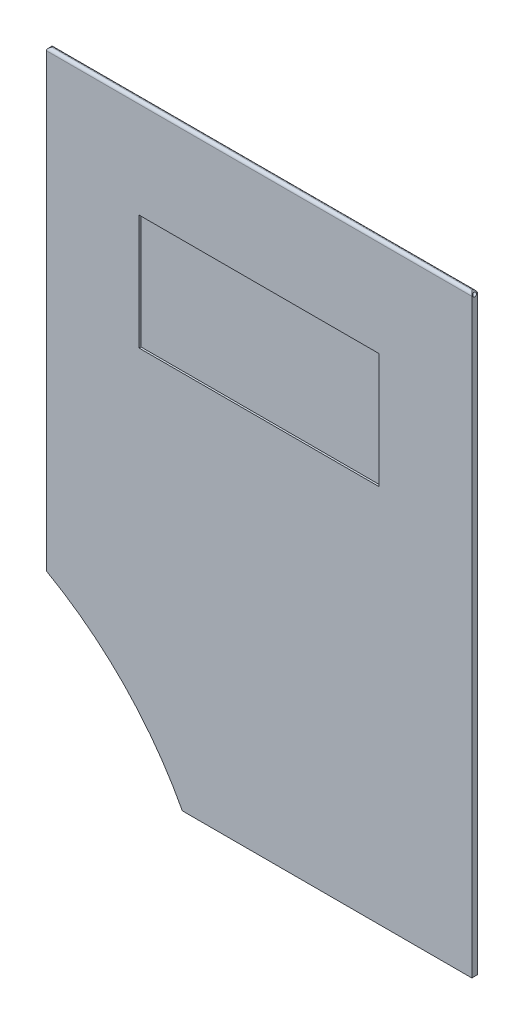
ISO-10303-21;
HEADER;
FILE_DESCRIPTION(('STEP AP214'),'2;1');
FILE_NAME('part.step','',(''),(''),'','','');
FILE_SCHEMA(('AUTOMOTIVE_DESIGN { 1 0 10303 214 1 1 1 1 }'));
ENDSEC;
DATA;
#1=APPLICATION_CONTEXT('core data for automotive mechanical design processes');
#2=APPLICATION_PROTOCOL_DEFINITION('international standard','automotive_design',2000,#1);
#3=PRODUCT_CONTEXT('',#1,'mechanical');
#4=PRODUCT('Part','Part','',(#3));
#5=PRODUCT_RELATED_PRODUCT_CATEGORY('part','',(#4));
#6=PRODUCT_DEFINITION_FORMATION('','',#4);
#7=PRODUCT_DEFINITION_CONTEXT('part definition',#1,'design');
#8=PRODUCT_DEFINITION('design','',#6,#7);
#9=PRODUCT_DEFINITION_SHAPE('','',#8);
#10=(LENGTH_UNIT() NAMED_UNIT(*) SI_UNIT(.MILLI.,.METRE.));
#11=(NAMED_UNIT(*) PLANE_ANGLE_UNIT() SI_UNIT($,.RADIAN.));
#12=(NAMED_UNIT(*) SI_UNIT($,.STERADIAN.) SOLID_ANGLE_UNIT());
#13=UNCERTAINTY_MEASURE_WITH_UNIT(LENGTH_MEASURE(1.E-05),#10,'distance_accuracy_value','');
#14=(GEOMETRIC_REPRESENTATION_CONTEXT(3) GLOBAL_UNCERTAINTY_ASSIGNED_CONTEXT((#13)) GLOBAL_UNIT_ASSIGNED_CONTEXT((#10,
#11,#12)) REPRESENTATION_CONTEXT('',''));
#15=CARTESIAN_POINT('',(0.,0.,0.));
#16=DIRECTION('',(0.,0.,1.));
#17=DIRECTION('',(1.,0.,0.));
#18=AXIS2_PLACEMENT_3D('',#15,#16,#17);
#19=CARTESIAN_POINT('',(-525.375764271538,-753.410434533379,0.));
#20=DIRECTION('',(0.,0.,1.));
#21=DIRECTION('',(1.,0.,0.));
#22=AXIS2_PLACEMENT_3D('',#19,#20,#21);
#23=PLANE('',#22);
#24=DIRECTION('',(0.,1.,0.));
#25=VECTOR('',#24,1.);
#26=CARTESIAN_POINT('',(-653.091871246219,-753.410434533379,0.));
#27=LINE('',#26,#25);
#28=CARTESIAN_POINT('',(-653.091871246219,137.849062600608,0.));
#29=VERTEX_POINT('',#28);
#30=CARTESIAN_POINT('',(-653.091871246219,372.551613641768,0.));
#31=VERTEX_POINT('',#30);
#32=EDGE_CURVE('E230',#29,#31,#27,.T.);
#33=ORIENTED_EDGE('',*,*,#32,.T.);
#34=DIRECTION('',(1.,0.,0.));
#35=VECTOR('',#34,1.);
#36=CARTESIAN_POINT('',(-431.491871246219,372.551613641768,0.));
#37=LINE('',#36,#35);
#38=CARTESIAN_POINT('',(-431.491871246219,372.551613641768,0.));
#39=VERTEX_POINT('',#38);
#40=EDGE_CURVE('E11',#31,#39,#37,.T.);
#41=ORIENTED_EDGE('',*,*,#40,.T.);
#42=DIRECTION('',(0.,1.,0.));
#43=VECTOR('',#42,1.);
#44=CARTESIAN_POINT('',(-431.491871246219,-753.410434533379,0.));
#45=LINE('',#44,#43);
#46=CARTESIAN_POINT('',(-431.491871246219,65.0516136417681,0.));
#47=VERTEX_POINT('',#46);
#48=EDGE_CURVE('E245',#47,#39,#45,.T.);
#49=ORIENTED_EDGE('',*,*,#48,.F.);
#50=DIRECTION('',(-1.,0.,0.));
#51=VECTOR('',#50,1.);
#52=CARTESIAN_POINT('',(-525.375764271538,65.0516136417681,0.));
#53=LINE('',#52,#51);
#54=CARTESIAN_POINT('',(-582.293881309159,65.0516136417681,0.));
#55=VERTEX_POINT('',#54);
#56=EDGE_CURVE('E242',#47,#55,#53,.T.);
#57=ORIENTED_EDGE('',*,*,#56,.T.);
#58=CARTESIAN_POINT('',(-741.491871246218,-18.9483863582319,0.));
#59=DIRECTION('',(0.,0.,1.));
#60=DIRECTION('',(1.,0.,0.));
#61=AXIS2_PLACEMENT_3D('',#58,#59,#60);
#62=CIRCLE('',#61,180.);
#63=EDGE_CURVE('E222',#55,#29,#62,.T.);
#64=ORIENTED_EDGE('',*,*,#63,.T.);
#65=EDGE_LOOP('',(#33,#41,#49,#57,#64));
#66=FACE_BOUND('',#65,.T.);
#67=DIRECTION('',(0.,-1.,0.));
#68=VECTOR('',#67,1.);
#69=CARTESIAN_POINT('',(-604.791871246219,218.801613641768,0.));
#70=LINE('',#69,#68);
#71=CARTESIAN_POINT('',(-604.791871246219,322.551613641768,0.));
#72=VERTEX_POINT('',#71);
#73=CARTESIAN_POINT('',(-604.791871246219,262.551613641768,0.));
#74=VERTEX_POINT('',#73);
#75=EDGE_CURVE('E63',#72,#74,#70,.T.);
#76=ORIENTED_EDGE('',*,*,#75,.T.);
#77=DIRECTION('',(-1.,0.,0.));
#78=VECTOR('',#77,1.);
#79=CARTESIAN_POINT('',(-837.248489039139,262.551613641768,0.));
#80=LINE('',#79,#78);
#81=CARTESIAN_POINT('',(-479.791871246219,262.551613641768,0.));
#82=VERTEX_POINT('',#81);
#83=EDGE_CURVE('E193',#82,#74,#80,.T.);
#84=ORIENTED_EDGE('',*,*,#83,.F.);
#85=DIRECTION('',(0.,-1.,0.));
#86=VECTOR('',#85,1.);
#87=CARTESIAN_POINT('',(-479.791871246219,218.801613641768,0.));
#88=LINE('',#87,#86);
#89=CARTESIAN_POINT('',(-479.791871246219,322.551613641768,0.));
#90=VERTEX_POINT('',#89);
#91=EDGE_CURVE('E206',#90,#82,#88,.T.);
#92=ORIENTED_EDGE('',*,*,#91,.F.);
#93=DIRECTION('',(-1.,0.,0.));
#94=VECTOR('',#93,1.);
#95=CARTESIAN_POINT('',(-837.248489039139,322.551613641768,0.));
#96=LINE('',#95,#94);
#97=EDGE_CURVE('E203',#90,#72,#96,.T.);
#98=ORIENTED_EDGE('',*,*,#97,.T.);
#99=EDGE_LOOP('',(#76,#84,#92,#98));
#100=FACE_BOUND('',#99,.T.);
#101=ADVANCED_FACE('F37',(#66,#100),#23,.F.);
#102=CARTESIAN_POINT('',(-741.491871246218,-18.9483863582319,3.));
#103=DIRECTION('',(0.,0.,-1.));
#104=DIRECTION('',(-1.,0.,0.));
#105=AXIS2_PLACEMENT_3D('',#102,#103,#104);
#106=CYLINDRICAL_SURFACE('',#105,180.);
#107=ORIENTED_EDGE('',*,*,#63,.F.);
#108=DIRECTION('',(0.,0.,-1.));
#109=VECTOR('',#108,1.);
#110=CARTESIAN_POINT('',(-582.293881309159,65.0516136417681,3.));
#111=LINE('',#110,#109);
#112=CARTESIAN_POINT('',(-582.293881309159,65.0516136417681,3.));
#113=VERTEX_POINT('',#112);
#114=EDGE_CURVE('E253',#113,#55,#111,.T.);
#115=ORIENTED_EDGE('',*,*,#114,.F.);
#116=CARTESIAN_POINT('',(-741.491871246218,-18.9483863582319,3.));
#117=DIRECTION('',(0.,0.,1.));
#118=DIRECTION('',(1.,0.,0.));
#119=AXIS2_PLACEMENT_3D('',#116,#117,#118);
#120=CIRCLE('',#119,180.);
#121=CARTESIAN_POINT('',(-653.091871246219,137.849062600608,3.));
#122=VERTEX_POINT('',#121);
#123=EDGE_CURVE('E226',#113,#122,#120,.T.);
#124=ORIENTED_EDGE('',*,*,#123,.T.);
#125=DIRECTION('',(0.,0.,-1.));
#126=VECTOR('',#125,1.);
#127=CARTESIAN_POINT('',(-653.091871246219,137.849062600608,3.));
#128=LINE('',#127,#126);
#129=EDGE_CURVE('E239',#122,#29,#128,.T.);
#130=ORIENTED_EDGE('',*,*,#129,.T.);
#131=EDGE_LOOP('',(#107,#115,#124,#130));
#132=FACE_BOUND('',#131,.T.);
#133=ADVANCED_FACE('F288',(#132),#106,.F.);
#134=CARTESIAN_POINT('',(-525.375764271538,65.0516136417681,3.));
#135=DIRECTION('',(0.,-1.,0.));
#136=DIRECTION('',(1.,0.,0.));
#137=AXIS2_PLACEMENT_3D('',#134,#135,#136);
#138=PLANE('',#137);
#139=ORIENTED_EDGE('',*,*,#56,.F.);
#140=DIRECTION('',(0.,0.,-1.));
#141=VECTOR('',#140,1.);
#142=CARTESIAN_POINT('',(-431.491871246219,65.0516136417681,3.));
#143=LINE('',#142,#141);
#144=CARTESIAN_POINT('',(-431.491871246219,65.0516136417681,3.));
#145=VERTEX_POINT('',#144);
#146=EDGE_CURVE('E251',#145,#47,#143,.T.);
#147=ORIENTED_EDGE('',*,*,#146,.F.);
#148=DIRECTION('',(-1.,0.,0.));
#149=VECTOR('',#148,1.);
#150=CARTESIAN_POINT('',(-525.375764271538,65.0516136417681,3.));
#151=LINE('',#150,#149);
#152=EDGE_CURVE('E229',#145,#113,#151,.T.);
#153=ORIENTED_EDGE('',*,*,#152,.T.);
#154=ORIENTED_EDGE('',*,*,#114,.T.);
#155=EDGE_LOOP('',(#139,#147,#153,#154));
#156=FACE_BOUND('',#155,.T.);
#157=ADVANCED_FACE('F296',(#156),#138,.T.);
#158=CARTESIAN_POINT('',(-431.491871246219,-753.410434533379,3.));
#159=DIRECTION('',(-1.,0.,0.));
#160=DIRECTION('',(0.,0.,1.));
#161=AXIS2_PLACEMENT_3D('',#158,#159,#160);
#162=PLANE('',#161);
#163=ORIENTED_EDGE('',*,*,#48,.T.);
#164=DIRECTION('',(0.,0.,-1.));
#165=VECTOR('',#164,1.);
#166=CARTESIAN_POINT('',(-431.491871246219,372.551613641768,3.));
#167=LINE('',#166,#165);
#168=CARTESIAN_POINT('',(-431.491871246219,372.551613641768,0.5));
#169=VERTEX_POINT('',#168);
#170=EDGE_CURVE('E257',#39,#169,#167,.F.);
#171=ORIENTED_EDGE('',*,*,#170,.T.);
#172=CARTESIAN_POINT('',(-431.491871246219,372.551613641768,1.5));
#173=DIRECTION('',(1.,0.,0.));
#174=DIRECTION('',(0.,0.,-1.));
#175=AXIS2_PLACEMENT_3D('',#172,#173,#174);
#176=CIRCLE('',#175,1.);
#177=CARTESIAN_POINT('',(-431.491871246219,372.551613641768,2.5));
#178=VERTEX_POINT('',#177);
#179=EDGE_CURVE('E223',#178,#169,#176,.T.);
#180=ORIENTED_EDGE('',*,*,#179,.F.);
#181=DIRECTION('',(0.,0.,-1.));
#182=VECTOR('',#181,1.);
#183=CARTESIAN_POINT('',(-431.491871246219,372.551613641768,3.));
#184=LINE('',#183,#182);
#185=CARTESIAN_POINT('',(-431.491871246219,372.551613641768,3.));
#186=VERTEX_POINT('',#185);
#187=EDGE_CURVE('E255',#178,#186,#184,.F.);
#188=ORIENTED_EDGE('',*,*,#187,.T.);
#189=DIRECTION('',(0.,1.,0.));
#190=VECTOR('',#189,1.);
#191=CARTESIAN_POINT('',(-431.491871246219,-753.410434533379,3.));
#192=LINE('',#191,#190);
#193=EDGE_CURVE('E233',#145,#186,#192,.T.);
#194=ORIENTED_EDGE('',*,*,#193,.F.);
#195=ORIENTED_EDGE('',*,*,#146,.T.);
#196=EDGE_LOOP('',(#163,#171,#180,#188,#194,#195));
#197=FACE_BOUND('',#196,.T.);
#198=ADVANCED_FACE('F292',(#197),#162,.F.);
#199=CARTESIAN_POINT('',(-653.091871246219,-753.410434533379,3.));
#200=DIRECTION('',(-1.,0.,0.));
#201=DIRECTION('',(0.,0.,1.));
#202=AXIS2_PLACEMENT_3D('',#199,#200,#201);
#203=PLANE('',#202);
#204=DIRECTION('',(0.,1.,0.));
#205=VECTOR('',#204,1.);
#206=CARTESIAN_POINT('',(-653.091871246219,-753.410434533379,3.));
#207=LINE('',#206,#205);
#208=CARTESIAN_POINT('',(-653.091871246219,372.551613641768,3.));
#209=VERTEX_POINT('',#208);
#210=EDGE_CURVE('E236',#122,#209,#207,.T.);
#211=ORIENTED_EDGE('',*,*,#210,.T.);
#212=DIRECTION('',(0.,0.,-1.));
#213=VECTOR('',#212,1.);
#214=CARTESIAN_POINT('',(-653.091871246219,372.551613641768,3.));
#215=LINE('',#214,#213);
#216=CARTESIAN_POINT('',(-653.091871246219,372.551613641768,2.5));
#217=VERTEX_POINT('',#216);
#218=EDGE_CURVE('E47',#209,#217,#215,.T.);
#219=ORIENTED_EDGE('',*,*,#218,.T.);
#220=CARTESIAN_POINT('',(-653.091871246219,372.551613641768,1.5));
#221=DIRECTION('',(1.,0.,0.));
#222=DIRECTION('',(0.,0.,-1.));
#223=AXIS2_PLACEMENT_3D('',#220,#221,#222);
#224=CIRCLE('',#223,1.);
#225=CARTESIAN_POINT('',(-653.091871246219,372.551613641768,0.5));
#226=VERTEX_POINT('',#225);
#227=EDGE_CURVE('E219',#217,#226,#224,.T.);
#228=ORIENTED_EDGE('',*,*,#227,.T.);
#229=DIRECTION('',(0.,0.,-1.));
#230=VECTOR('',#229,1.);
#231=CARTESIAN_POINT('',(-653.091871246219,372.551613641768,3.));
#232=LINE('',#231,#230);
#233=EDGE_CURVE('E337',#226,#31,#232,.T.);
#234=ORIENTED_EDGE('',*,*,#233,.T.);
#235=ORIENTED_EDGE('',*,*,#32,.F.);
#236=ORIENTED_EDGE('',*,*,#129,.F.);
#237=EDGE_LOOP('',(#211,#219,#228,#234,#235,#236));
#238=FACE_BOUND('',#237,.T.);
#239=ADVANCED_FACE('F284',(#238),#203,.T.);
#240=CARTESIAN_POINT('',(-525.375764271538,-753.410434533379,3.));
#241=DIRECTION('',(0.,0.,1.));
#242=DIRECTION('',(1.,0.,0.));
#243=AXIS2_PLACEMENT_3D('',#240,#241,#242);
#244=PLANE('',#243);
#245=DIRECTION('',(1.,0.,0.));
#246=VECTOR('',#245,1.);
#247=CARTESIAN_POINT('',(-542.291871246219,262.551613641768,3.));
#248=LINE('',#247,#246);
#249=CARTESIAN_POINT('',(-604.791871246219,262.551613641768,3.));
#250=VERTEX_POINT('',#249);
#251=CARTESIAN_POINT('',(-479.791871246219,262.551613641768,3.));
#252=VERTEX_POINT('',#251);
#253=EDGE_CURVE('E55',#250,#252,#248,.T.);
#254=ORIENTED_EDGE('',*,*,#253,.F.);
#255=DIRECTION('',(0.,1.,0.));
#256=VECTOR('',#255,1.);
#257=CARTESIAN_POINT('',(-604.791871246219,-76.1550041511523,3.));
#258=LINE('',#257,#256);
#259=CARTESIAN_POINT('',(-604.791871246219,322.551613641768,3.));
#260=VERTEX_POINT('',#259);
#261=EDGE_CURVE('E172',#250,#260,#258,.T.);
#262=ORIENTED_EDGE('',*,*,#261,.T.);
#263=DIRECTION('',(1.,0.,0.));
#264=VECTOR('',#263,1.);
#265=CARTESIAN_POINT('',(-542.291871246219,322.551613641768,3.));
#266=LINE('',#265,#264);
#267=CARTESIAN_POINT('',(-479.791871246219,322.551613641768,3.));
#268=VERTEX_POINT('',#267);
#269=EDGE_CURVE('E175',#260,#268,#266,.T.);
#270=ORIENTED_EDGE('',*,*,#269,.T.);
#271=DIRECTION('',(0.,1.,0.));
#272=VECTOR('',#271,1.);
#273=CARTESIAN_POINT('',(-479.791871246219,-76.1550041511523,3.));
#274=LINE('',#273,#272);
#275=EDGE_CURVE('E181',#252,#268,#274,.T.);
#276=ORIENTED_EDGE('',*,*,#275,.F.);
#277=EDGE_LOOP('',(#254,#262,#270,#276));
#278=FACE_BOUND('',#277,.T.);
#279=ORIENTED_EDGE('',*,*,#193,.T.);
#280=DIRECTION('',(1.,0.,0.));
#281=VECTOR('',#280,1.);
#282=CARTESIAN_POINT('',(-525.375764271538,372.551613641768,3.));
#283=LINE('',#282,#281);
#284=EDGE_CURVE('E338',#186,#209,#283,.F.);
#285=ORIENTED_EDGE('',*,*,#284,.T.);
#286=ORIENTED_EDGE('',*,*,#210,.F.);
#287=ORIENTED_EDGE('',*,*,#123,.F.);
#288=ORIENTED_EDGE('',*,*,#152,.F.);
#289=EDGE_LOOP('',(#279,#285,#286,#287,#288));
#290=FACE_BOUND('',#289,.T.);
#291=ADVANCED_FACE('F277',(#278,#290),#244,.T.);
#292=CARTESIAN_POINT('',(-653.091871246219,372.551613641768,1.5));
#293=DIRECTION('',(1.,0.,0.));
#294=DIRECTION('',(0.,0.,-1.));
#295=AXIS2_PLACEMENT_3D('',#292,#293,#294);
#296=CYLINDRICAL_SURFACE('',#295,1.);
#297=ORIENTED_EDGE('',*,*,#227,.F.);
#298=CARTESIAN_POINT('',(-653.091871246219,372.551613641768,2.5));
#299=CARTESIAN_POINT('',(-653.091874316553,372.576836632623,2.50000213248189));
#300=CARTESIAN_POINT('',(-653.091234398867,372.602045418243,2.49904499371487));
#301=CARTESIAN_POINT('',(-653.088702447985,372.652242754679,2.49524199874773));
#302=CARTESIAN_POINT('',(-653.086811126063,372.677231422435,2.49239721544421));
#303=CARTESIAN_POINT('',(-653.079344562009,372.751276887335,2.48112709883326));
#304=CARTESIAN_POINT('',(-653.071975712256,372.79976982417,2.46996503151942));
#305=CARTESIAN_POINT('',(-653.053129092996,372.893701241715,2.44095418700607));
#306=CARTESIAN_POINT('',(-653.041658957294,372.939145212124,2.42311782994398));
#307=CARTESIAN_POINT('',(-653.015518727622,373.02627126744,2.38149564691463));
#308=CARTESIAN_POINT('',(-653.000844527774,373.067948427536,2.35770218136302));
#309=CARTESIAN_POINT('',(-652.968006792718,373.150259454655,2.30266965775551));
#310=CARTESIAN_POINT('',(-652.949653381908,373.190509140596,2.2709720016599));
#311=CARTESIAN_POINT('',(-652.911780319663,373.265481908455,2.20213023620318));
#312=CARTESIAN_POINT('',(-652.892259164069,373.300197641751,2.16497900858321));
#313=CARTESIAN_POINT('',(-652.850512413011,373.368725449215,2.07947349446962));
#314=CARTESIAN_POINT('',(-652.828346273516,373.401530051647,2.03027648073677));
#315=CARTESIAN_POINT('',(-652.787291716876,373.458365749658,1.9258175326237));
#316=CARTESIAN_POINT('',(-652.768397616499,373.48241213927,1.87056639195637));
#317=CARTESIAN_POINT('',(-652.741752635542,373.514983750701,1.77164456216703));
#318=CARTESIAN_POINT('',(-652.732359480683,373.525985767138,1.72923620443708));
#319=CARTESIAN_POINT('',(-652.718161143846,373.542366675033,1.64262819627002));
#320=CARTESIAN_POINT('',(-652.713348100945,373.547755202528,1.5984317512113));
#321=CARTESIAN_POINT('',(-652.709054274315,373.55257046257,1.50926261471995));
#322=CARTESIAN_POINT('',(-652.709595258867,373.551972856717,1.4642874971401));
#323=CARTESIAN_POINT('',(-652.715970122504,373.544801549508,1.37518252218938));
#324=CARTESIAN_POINT('',(-652.721808486789,373.538222784,1.33105341345566));
#325=CARTESIAN_POINT('',(-652.737507212834,373.519938570797,1.2467662776834));
#326=CARTESIAN_POINT('',(-652.747178780396,373.508472091786,1.20651894747415));
#327=CARTESIAN_POINT('',(-652.769419481186,373.480964078911,1.12848779270326));
#328=CARTESIAN_POINT('',(-652.781989540021,373.464921083189,1.09070476004815));
#329=CARTESIAN_POINT('',(-652.811692141144,373.424982862542,1.01048753786351));
#330=CARTESIAN_POINT('',(-652.829232646797,373.40015421116,0.968670500966199));
#331=CARTESIAN_POINT('',(-652.865328737211,373.344958727432,0.889308701198421));
#332=CARTESIAN_POINT('',(-652.883885564331,373.31458500598,0.85176934814494));
#333=CARTESIAN_POINT('',(-652.924586303111,373.241522636608,0.773731920925078));
#334=CARTESIAN_POINT('',(-652.946641679551,373.197590644548,0.734338884622684));
#335=CARTESIAN_POINT('',(-652.987958878657,373.102624491006,0.663406423713585));
#336=CARTESIAN_POINT('',(-653.007222898767,373.051595978839,0.631860807190035));
#337=CARTESIAN_POINT('',(-653.037607188925,372.954016137274,0.583246943502027));
#338=CARTESIAN_POINT('',(-653.049583301069,372.908540211483,0.564554000713045));
#339=CARTESIAN_POINT('',(-653.069420392735,372.814559429165,0.533931258474181));
#340=CARTESIAN_POINT('',(-653.077290227597,372.766061345187,0.521986900799666));
#341=CARTESIAN_POINT('',(-653.085765844656,372.689561061186,0.509176214174975));
#342=CARTESIAN_POINT('',(-653.088046724255,372.662145969867,0.505743657680968));
#343=CARTESIAN_POINT('',(-653.091102373248,372.607030924786,0.501153051464653));
#344=CARTESIAN_POINT('',(-653.091876460959,372.57933084779,0.499996031208196));
#345=CARTESIAN_POINT('',(-653.091871246219,372.551613641768,0.5));
#346=B_SPLINE_CURVE_WITH_KNOTS('',3,(#298,#299,#300,#301,#302,#303,#304,#305,#306,#307,#308,
#309,#310,#311,#312,#313,#314,#315,#316,#317,#318,#319,#320,#321,#322,#323,#324,#325,#326,#327,
#328,#329,#330,#331,#332,#333,#334,#335,#336,#337,#338,#339,#340,#341,#342,#343,#344,#345),
.UNSPECIFIED.,.F.,.F.,(4,2,2,2,2,2,2,2,2,2,2,2,2,2,2,2,2,2,2,2,2,2,2,4),(0.,0.0756155393796833,
0.151188137283812,0.301278773145155,0.451091484295499,0.601097313024727,0.763749621107919,
0.926616150140312,1.11518883123059,1.30343062019747,1.43732188431408,1.57098293189718,
1.70518763798529,1.83950607898823,1.96789901619187,2.09633301145896,2.2508911396145,
2.40564261145948,2.59373489293892,2.7816782882283,2.93287425225026,3.0837427947093,
3.16678966855182,3.24987410464933),.UNSPECIFIED.);
#347=EDGE_CURVE('E260',#217,#226,#346,.T.);
#348=ORIENTED_EDGE('',*,*,#347,.T.);
#349=EDGE_LOOP('',(#297,#348));
#350=FACE_BOUND('',#349,.T.);
#351=ORIENTED_EDGE('',*,*,#179,.T.);
#352=CARTESIAN_POINT('',(-431.491871246219,372.551613641768,0.5));
#353=CARTESIAN_POINT('',(-431.491868175885,372.576836632623,0.49999786751811));
#354=CARTESIAN_POINT('',(-431.492508093571,372.602045418243,0.500955006285135));
#355=CARTESIAN_POINT('',(-431.495040044452,372.652242754679,0.504758001252276));
#356=CARTESIAN_POINT('',(-431.496931366375,372.677231422435,0.5076027845558));
#357=CARTESIAN_POINT('',(-431.504397930429,372.751276887335,0.518872901166758));
#358=CARTESIAN_POINT('',(-431.511766780181,372.79976982417,0.530034968480598));
#359=CARTESIAN_POINT('',(-431.530613399441,372.893701241715,0.559045812993952));
#360=CARTESIAN_POINT('',(-431.542083535143,372.939145212124,0.57688217005606));
#361=CARTESIAN_POINT('',(-431.568223764815,373.02627126744,0.618504353085429));
#362=CARTESIAN_POINT('',(-431.582897964663,373.067948427536,0.64229781863705));
#363=CARTESIAN_POINT('',(-431.615735699719,373.150259454655,0.697330342244581));
#364=CARTESIAN_POINT('',(-431.634089110529,373.190509140596,0.729027998340213));
#365=CARTESIAN_POINT('',(-431.671962172774,373.265481908455,0.797869763796929));
#366=CARTESIAN_POINT('',(-431.691483328369,373.300197641751,0.835020991416861));
#367=CARTESIAN_POINT('',(-431.733230079426,373.368725449215,0.92052650553043));
#368=CARTESIAN_POINT('',(-431.755396218921,373.401530051647,0.96972351926331));
#369=CARTESIAN_POINT('',(-431.796450775561,373.458365749658,1.0741824673764));
#370=CARTESIAN_POINT('',(-431.815344875938,373.48241213927,1.12943360804372));
#371=CARTESIAN_POINT('',(-431.841989856895,373.514983750701,1.22835543783305));
#372=CARTESIAN_POINT('',(-431.851383011754,373.525985767138,1.270763795563));
#373=CARTESIAN_POINT('',(-431.865581348591,373.542366675033,1.35737180373006));
#374=CARTESIAN_POINT('',(-431.870394391492,373.547755202528,1.40156824878876));
#375=CARTESIAN_POINT('',(-431.874688218122,373.55257046257,1.4907373852801));
#376=CARTESIAN_POINT('',(-431.87414723357,373.551972856717,1.53571250285995));
#377=CARTESIAN_POINT('',(-431.867772369933,373.544801549508,1.62481747781066));
#378=CARTESIAN_POINT('',(-431.861934005649,373.538222784,1.66894658654438));
#379=CARTESIAN_POINT('',(-431.846235279603,373.519938570797,1.75323372231664));
#380=CARTESIAN_POINT('',(-431.836563712041,373.508472091786,1.79348105252589));
#381=CARTESIAN_POINT('',(-431.814323011251,373.480964078911,1.87151220729678));
#382=CARTESIAN_POINT('',(-431.801752952416,373.464921083189,1.90929523995188));
#383=CARTESIAN_POINT('',(-431.772050351294,373.424982862542,1.98951246213651));
#384=CARTESIAN_POINT('',(-431.75450984564,373.40015421116,2.03132949903383));
#385=CARTESIAN_POINT('',(-431.718413755226,373.344958727432,2.11069129880161));
#386=CARTESIAN_POINT('',(-431.699856928106,373.31458500598,2.14823065185508));
#387=CARTESIAN_POINT('',(-431.659156189326,373.241522636608,2.22626807907493));
#388=CARTESIAN_POINT('',(-431.637100812886,373.197590644548,2.26566111537733));
#389=CARTESIAN_POINT('',(-431.595783613781,373.102624491006,2.33659357628644));
#390=CARTESIAN_POINT('',(-431.576519593671,373.051595978839,2.36813919280999));
#391=CARTESIAN_POINT('',(-431.546135303512,372.954016137274,2.41675305649799));
#392=CARTESIAN_POINT('',(-431.534159191369,372.908540211483,2.43544599928696));
#393=CARTESIAN_POINT('',(-431.514322099702,372.814559429165,2.46606874152582));
#394=CARTESIAN_POINT('',(-431.50645226484,372.766061345187,2.47801309920034));
#395=CARTESIAN_POINT('',(-431.497976647781,372.689561061186,2.49082378582503));
#396=CARTESIAN_POINT('',(-431.495695768183,372.662145969867,2.49425634231903));
#397=CARTESIAN_POINT('',(-431.492640119189,372.607030924786,2.49884694853534));
#398=CARTESIAN_POINT('',(-431.491866031478,372.57933084779,2.5000039687918));
#399=CARTESIAN_POINT('',(-431.491871246219,372.551613641768,2.5));
#400=B_SPLINE_CURVE_WITH_KNOTS('',3,(#352,#353,#354,#355,#356,#357,#358,#359,#360,#361,#362,
#363,#364,#365,#366,#367,#368,#369,#370,#371,#372,#373,#374,#375,#376,#377,#378,#379,#380,#381,
#382,#383,#384,#385,#386,#387,#388,#389,#390,#391,#392,#393,#394,#395,#396,#397,#398,#399),
.UNSPECIFIED.,.F.,.F.,(4,2,2,2,2,2,2,2,2,2,2,2,2,2,2,2,2,2,2,2,2,2,2,4),(0.,0.0756155393797405,
0.15118813728387,0.30127877314516,0.451091484295568,0.601097313024821,0.763749621108091,
0.926616150140299,1.11518883123066,1.3034306201975,1.43732188431409,1.57098293189717,
1.70518763798526,1.8395060789882,1.96789901619182,2.09633301145893,2.25089113961448,
2.40564261145946,2.59373489293885,2.78167828822823,2.93287425225019,3.08374279470928,
3.16678966855174,3.2498741046492),.UNSPECIFIED.);
#401=EDGE_CURVE('E266',#169,#178,#400,.T.);
#402=ORIENTED_EDGE('',*,*,#401,.T.);
#403=EDGE_LOOP('',(#351,#402));
#404=FACE_BOUND('',#403,.T.);
#405=ADVANCED_FACE('F272',(#350,#404),#296,.F.);
#406=CARTESIAN_POINT('',(-651.591871246219,372.551613641768,3.));
#407=DIRECTION('',(0.,0.,-1.));
#408=DIRECTION('',(-1.,0.,0.));
#409=AXIS2_PLACEMENT_3D('',#406,#407,#408);
#410=CYLINDRICAL_SURFACE('',#409,1.5);
#411=ORIENTED_EDGE('',*,*,#347,.F.);
#412=ORIENTED_EDGE('',*,*,#218,.F.);
#413=CARTESIAN_POINT('',(-651.591871246219,372.551613641768,1.5));
#414=DIRECTION('',(-0.707106781186547,0.,-0.707106781186547));
#415=DIRECTION('',(0.707106781186547,0.,-0.707106781186547));
#416=AXIS2_PLACEMENT_3D('',#413,#414,#415);
#417=ELLIPSE('',#416,2.12132034355964,1.5);
#418=CARTESIAN_POINT('',(-651.591871246219,374.051613641768,1.5));
#419=VERTEX_POINT('',#418);
#420=EDGE_CURVE('E42',#419,#209,#417,.F.);
#421=ORIENTED_EDGE('',*,*,#420,.F.);
#422=CARTESIAN_POINT('',(-651.591871246219,372.551613641768,1.5));
#423=DIRECTION('',(-0.707106781186547,0.,0.707106781186547));
#424=DIRECTION('',(-0.707106781186547,0.,-0.707106781186547));
#425=AXIS2_PLACEMENT_3D('',#422,#423,#424);
#426=ELLIPSE('',#425,2.12132034355964,1.5);
#427=EDGE_CURVE('E328',#31,#419,#426,.F.);
#428=ORIENTED_EDGE('',*,*,#427,.F.);
#429=ORIENTED_EDGE('',*,*,#233,.F.);
#430=EDGE_LOOP('',(#411,#412,#421,#428,#429));
#431=FACE_BOUND('',#430,.T.);
#432=ADVANCED_FACE('F39',(#431),#410,.T.);
#433=CARTESIAN_POINT('',(-525.375764271538,372.551613641768,1.5));
#434=DIRECTION('',(1.,0.,0.));
#435=DIRECTION('',(0.,0.,-1.));
#436=AXIS2_PLACEMENT_3D('',#433,#434,#435);
#437=CYLINDRICAL_SURFACE('',#436,1.5);
#438=DIRECTION('',(1.,0.,0.));
#439=VECTOR('',#438,1.);
#440=CARTESIAN_POINT('',(-525.375764271538,374.051613641768,1.5));
#441=LINE('',#440,#439);
#442=CARTESIAN_POINT('',(-432.991871246219,374.051613641768,1.5));
#443=VERTEX_POINT('',#442);
#444=EDGE_CURVE('E321',#419,#443,#441,.T.);
#445=ORIENTED_EDGE('',*,*,#444,.F.);
#446=ORIENTED_EDGE('',*,*,#420,.T.);
#447=ORIENTED_EDGE('',*,*,#284,.F.);
#448=CARTESIAN_POINT('',(-432.991871246219,372.551613641768,1.5));
#449=DIRECTION('',(0.707106781186547,0.,-0.707106781186547));
#450=DIRECTION('',(0.707106781186547,0.,0.707106781186547));
#451=AXIS2_PLACEMENT_3D('',#448,#449,#450);
#452=ELLIPSE('',#451,2.12132034355964,1.5);
#453=EDGE_CURVE('E325',#443,#186,#452,.T.);
#454=ORIENTED_EDGE('',*,*,#453,.F.);
#455=EDGE_LOOP('',(#445,#446,#447,#454));
#456=FACE_BOUND('',#455,.T.);
#457=ADVANCED_FACE('F310',(#456),#437,.T.);
#458=CARTESIAN_POINT('',(-525.375764271538,372.551613641768,1.5));
#459=DIRECTION('',(-1.,0.,0.));
#460=DIRECTION('',(0.,0.,1.));
#461=AXIS2_PLACEMENT_3D('',#458,#459,#460);
#462=CYLINDRICAL_SURFACE('',#461,1.5);
#463=ORIENTED_EDGE('',*,*,#427,.T.);
#464=ORIENTED_EDGE('',*,*,#444,.T.);
#465=CARTESIAN_POINT('',(-432.991871246219,372.551613641768,1.5));
#466=DIRECTION('',(-0.707106781186547,0.,-0.707106781186547));
#467=DIRECTION('',(-0.707106781186547,0.,0.707106781186547));
#468=AXIS2_PLACEMENT_3D('',#465,#466,#467);
#469=ELLIPSE('',#468,2.12132034355964,1.5);
#470=EDGE_CURVE('E213',#39,#443,#469,.F.);
#471=ORIENTED_EDGE('',*,*,#470,.F.);
#472=ORIENTED_EDGE('',*,*,#40,.F.);
#473=EDGE_LOOP('',(#463,#464,#471,#472));
#474=FACE_BOUND('',#473,.T.);
#475=ADVANCED_FACE('F307',(#474),#462,.T.);
#476=CARTESIAN_POINT('',(-432.991871246219,372.551613641768,3.));
#477=DIRECTION('',(0.,0.,1.));
#478=DIRECTION('',(1.,0.,0.));
#479=AXIS2_PLACEMENT_3D('',#476,#477,#478);
#480=CYLINDRICAL_SURFACE('',#479,1.5);
#481=ORIENTED_EDGE('',*,*,#401,.F.);
#482=ORIENTED_EDGE('',*,*,#170,.F.);
#483=ORIENTED_EDGE('',*,*,#470,.T.);
#484=ORIENTED_EDGE('',*,*,#453,.T.);
#485=ORIENTED_EDGE('',*,*,#187,.F.);
#486=EDGE_LOOP('',(#481,#482,#483,#484,#485));
#487=FACE_BOUND('',#486,.T.);
#488=ADVANCED_FACE('F303',(#487),#480,.T.);
#489=CARTESIAN_POINT('',(-604.791871246219,218.801613641768,1.));
#490=DIRECTION('',(1.,0.,0.));
#491=DIRECTION('',(0.,0.,-1.));
#492=AXIS2_PLACEMENT_3D('',#489,#490,#491);
#493=PLANE('',#492);
#494=ORIENTED_EDGE('',*,*,#75,.F.);
#495=DIRECTION('',(0.,0.,-1.));
#496=VECTOR('',#495,1.);
#497=CARTESIAN_POINT('',(-604.791871246219,322.551613641768,1.));
#498=LINE('',#497,#496);
#499=CARTESIAN_POINT('',(-604.791871246219,322.551613641768,1.));
#500=VERTEX_POINT('',#499);
#501=EDGE_CURVE('E201',#500,#72,#498,.T.);
#502=ORIENTED_EDGE('',*,*,#501,.F.);
#503=DIRECTION('',(0.,-1.,0.));
#504=VECTOR('',#503,1.);
#505=CARTESIAN_POINT('',(-604.791871246219,218.801613641768,1.));
#506=LINE('',#505,#504);
#507=CARTESIAN_POINT('',(-604.791871246219,262.551613641768,1.));
#508=VERTEX_POINT('',#507);
#509=EDGE_CURVE('E190',#500,#508,#506,.T.);
#510=ORIENTED_EDGE('',*,*,#509,.T.);
#511=DIRECTION('',(0.,0.,-1.));
#512=VECTOR('',#511,1.);
#513=CARTESIAN_POINT('',(-604.791871246219,262.551613641768,1.));
#514=LINE('',#513,#512);
#515=EDGE_CURVE('E211',#508,#74,#514,.T.);
#516=ORIENTED_EDGE('',*,*,#515,.T.);
#517=EDGE_LOOP('',(#494,#502,#510,#516));
#518=FACE_BOUND('',#517,.T.);
#519=ADVANCED_FACE('F279',(#518),#493,.T.);
#520=CARTESIAN_POINT('',(-837.248489039139,262.551613641768,1.));
#521=DIRECTION('',(0.,-1.,0.));
#522=DIRECTION('',(0.,0.,-1.));
#523=AXIS2_PLACEMENT_3D('',#520,#521,#522);
#524=PLANE('',#523);
#525=ORIENTED_EDGE('',*,*,#83,.T.);
#526=ORIENTED_EDGE('',*,*,#515,.F.);
#527=DIRECTION('',(-1.,0.,0.));
#528=VECTOR('',#527,1.);
#529=CARTESIAN_POINT('',(-837.248489039139,262.551613641768,1.));
#530=LINE('',#529,#528);
#531=CARTESIAN_POINT('',(-479.791871246219,262.551613641768,1.));
#532=VERTEX_POINT('',#531);
#533=EDGE_CURVE('E198',#532,#508,#530,.T.);
#534=ORIENTED_EDGE('',*,*,#533,.F.);
#535=DIRECTION('',(0.,0.,-1.));
#536=VECTOR('',#535,1.);
#537=CARTESIAN_POINT('',(-479.791871246219,262.551613641768,1.));
#538=LINE('',#537,#536);
#539=EDGE_CURVE('E214',#532,#82,#538,.T.);
#540=ORIENTED_EDGE('',*,*,#539,.T.);
#541=EDGE_LOOP('',(#525,#526,#534,#540));
#542=FACE_BOUND('',#541,.T.);
#543=ADVANCED_FACE('F369',(#542),#524,.F.);
#544=CARTESIAN_POINT('',(-479.791871246219,218.801613641768,1.));
#545=DIRECTION('',(1.,0.,0.));
#546=DIRECTION('',(0.,0.,-1.));
#547=AXIS2_PLACEMENT_3D('',#544,#545,#546);
#548=PLANE('',#547);
#549=ORIENTED_EDGE('',*,*,#91,.T.);
#550=ORIENTED_EDGE('',*,*,#539,.F.);
#551=DIRECTION('',(0.,-1.,0.));
#552=VECTOR('',#551,1.);
#553=CARTESIAN_POINT('',(-479.791871246219,218.801613641768,1.));
#554=LINE('',#553,#552);
#555=CARTESIAN_POINT('',(-479.791871246219,322.551613641768,1.));
#556=VERTEX_POINT('',#555);
#557=EDGE_CURVE('E195',#556,#532,#554,.T.);
#558=ORIENTED_EDGE('',*,*,#557,.F.);
#559=DIRECTION('',(0.,0.,-1.));
#560=VECTOR('',#559,1.);
#561=CARTESIAN_POINT('',(-479.791871246219,322.551613641768,1.));
#562=LINE('',#561,#560);
#563=EDGE_CURVE('E216',#556,#90,#562,.T.);
#564=ORIENTED_EDGE('',*,*,#563,.T.);
#565=EDGE_LOOP('',(#549,#550,#558,#564));
#566=FACE_BOUND('',#565,.T.);
#567=ADVANCED_FACE('F371',(#566),#548,.F.);
#568=CARTESIAN_POINT('',(-837.248489039139,322.551613641768,1.));
#569=DIRECTION('',(0.,-1.,0.));
#570=DIRECTION('',(0.,0.,-1.));
#571=AXIS2_PLACEMENT_3D('',#568,#569,#570);
#572=PLANE('',#571);
#573=ORIENTED_EDGE('',*,*,#97,.F.);
#574=ORIENTED_EDGE('',*,*,#563,.F.);
#575=DIRECTION('',(-1.,0.,0.));
#576=VECTOR('',#575,1.);
#577=CARTESIAN_POINT('',(-837.248489039139,322.551613641768,1.));
#578=LINE('',#577,#576);
#579=EDGE_CURVE('E192',#556,#500,#578,.T.);
#580=ORIENTED_EDGE('',*,*,#579,.T.);
#581=ORIENTED_EDGE('',*,*,#501,.T.);
#582=EDGE_LOOP('',(#573,#574,#580,#581));
#583=FACE_BOUND('',#582,.T.);
#584=ADVANCED_FACE('F360',(#583),#572,.T.);
#585=CARTESIAN_POINT('',(-837.248489039139,218.801613641768,1.));
#586=DIRECTION('',(0.,0.,-1.));
#587=DIRECTION('',(-1.,0.,0.));
#588=AXIS2_PLACEMENT_3D('',#585,#586,#587);
#589=PLANE('',#588);
#590=ORIENTED_EDGE('',*,*,#509,.F.);
#591=ORIENTED_EDGE('',*,*,#579,.F.);
#592=ORIENTED_EDGE('',*,*,#557,.T.);
#593=ORIENTED_EDGE('',*,*,#533,.T.);
#594=EDGE_LOOP('',(#590,#591,#592,#593));
#595=FACE_BOUND('',#594,.T.);
#596=ADVANCED_FACE('F365',(#595),#589,.T.);
#597=CARTESIAN_POINT('',(-542.291871246219,262.551613641768,2.));
#598=DIRECTION('',(0.,-1.,0.));
#599=DIRECTION('',(0.,0.,-1.));
#600=AXIS2_PLACEMENT_3D('',#597,#598,#599);
#601=PLANE('',#600);
#602=ORIENTED_EDGE('',*,*,#253,.T.);
#603=DIRECTION('',(0.,0.,1.));
#604=VECTOR('',#603,1.);
#605=CARTESIAN_POINT('',(-479.791871246219,262.551613641768,2.));
#606=LINE('',#605,#604);
#607=CARTESIAN_POINT('',(-479.791871246219,262.551613641768,2.));
#608=VERTEX_POINT('',#607);
#609=EDGE_CURVE('E151',#608,#252,#606,.T.);
#610=ORIENTED_EDGE('',*,*,#609,.F.);
#611=DIRECTION('',(1.,0.,0.));
#612=VECTOR('',#611,1.);
#613=CARTESIAN_POINT('',(-542.291871246219,262.551613641768,2.));
#614=LINE('',#613,#612);
#615=CARTESIAN_POINT('',(-604.791871246219,262.551613641768,2.));
#616=VERTEX_POINT('',#615);
#617=EDGE_CURVE('E155',#616,#608,#614,.T.);
#618=ORIENTED_EDGE('',*,*,#617,.F.);
#619=DIRECTION('',(0.,0.,1.));
#620=VECTOR('',#619,1.);
#621=CARTESIAN_POINT('',(-604.791871246219,262.551613641768,2.));
#622=LINE('',#621,#620);
#623=EDGE_CURVE('E185',#616,#250,#622,.T.);
#624=ORIENTED_EDGE('',*,*,#623,.T.);
#625=EDGE_LOOP('',(#602,#610,#618,#624));
#626=FACE_BOUND('',#625,.T.);
#627=ADVANCED_FACE('F153',(#626),#601,.F.);
#628=CARTESIAN_POINT('',(-604.791871246219,-76.1550041511523,2.));
#629=DIRECTION('',(1.,0.,0.));
#630=DIRECTION('',(0.,0.,-1.));
#631=AXIS2_PLACEMENT_3D('',#628,#629,#630);
#632=PLANE('',#631);
#633=ORIENTED_EDGE('',*,*,#261,.F.);
#634=ORIENTED_EDGE('',*,*,#623,.F.);
#635=DIRECTION('',(0.,1.,0.));
#636=VECTOR('',#635,1.);
#637=CARTESIAN_POINT('',(-604.791871246219,-76.1550041511523,2.));
#638=LINE('',#637,#636);
#639=CARTESIAN_POINT('',(-604.791871246219,322.551613641768,2.));
#640=VERTEX_POINT('',#639);
#641=EDGE_CURVE('E160',#616,#640,#638,.T.);
#642=ORIENTED_EDGE('',*,*,#641,.T.);
#643=DIRECTION('',(0.,0.,1.));
#644=VECTOR('',#643,1.);
#645=CARTESIAN_POINT('',(-604.791871246219,322.551613641768,2.));
#646=LINE('',#645,#644);
#647=EDGE_CURVE('E187',#640,#260,#646,.T.);
#648=ORIENTED_EDGE('',*,*,#647,.T.);
#649=EDGE_LOOP('',(#633,#634,#642,#648));
#650=FACE_BOUND('',#649,.T.);
#651=ADVANCED_FACE('F384',(#650),#632,.T.);
#652=CARTESIAN_POINT('',(-542.291871246219,322.551613641768,2.));
#653=DIRECTION('',(0.,-1.,0.));
#654=DIRECTION('',(0.,0.,-1.));
#655=AXIS2_PLACEMENT_3D('',#652,#653,#654);
#656=PLANE('',#655);
#657=ORIENTED_EDGE('',*,*,#269,.F.);
#658=ORIENTED_EDGE('',*,*,#647,.F.);
#659=DIRECTION('',(1.,0.,0.));
#660=VECTOR('',#659,1.);
#661=CARTESIAN_POINT('',(-542.291871246219,322.551613641768,2.));
#662=LINE('',#661,#660);
#663=CARTESIAN_POINT('',(-479.791871246219,322.551613641768,2.));
#664=VERTEX_POINT('',#663);
#665=EDGE_CURVE('E168',#640,#664,#662,.T.);
#666=ORIENTED_EDGE('',*,*,#665,.T.);
#667=DIRECTION('',(0.,0.,1.));
#668=VECTOR('',#667,1.);
#669=CARTESIAN_POINT('',(-479.791871246219,322.551613641768,2.));
#670=LINE('',#669,#668);
#671=EDGE_CURVE('E159',#664,#268,#670,.T.);
#672=ORIENTED_EDGE('',*,*,#671,.T.);
#673=EDGE_LOOP('',(#657,#658,#666,#672));
#674=FACE_BOUND('',#673,.T.);
#675=ADVANCED_FACE('F387',(#674),#656,.T.);
#676=CARTESIAN_POINT('',(-479.791871246219,-76.1550041511523,2.));
#677=DIRECTION('',(1.,0.,0.));
#678=DIRECTION('',(0.,0.,-1.));
#679=AXIS2_PLACEMENT_3D('',#676,#677,#678);
#680=PLANE('',#679);
#681=ORIENTED_EDGE('',*,*,#275,.T.);
#682=ORIENTED_EDGE('',*,*,#671,.F.);
#683=DIRECTION('',(0.,1.,0.));
#684=VECTOR('',#683,1.);
#685=CARTESIAN_POINT('',(-479.791871246219,-76.1550041511523,2.));
#686=LINE('',#685,#684);
#687=EDGE_CURVE('E164',#608,#664,#686,.T.);
#688=ORIENTED_EDGE('',*,*,#687,.F.);
#689=ORIENTED_EDGE('',*,*,#609,.T.);
#690=EDGE_LOOP('',(#681,#682,#688,#689));
#691=FACE_BOUND('',#690,.T.);
#692=ADVANCED_FACE('F165',(#691),#680,.F.);
#693=CARTESIAN_POINT('',(-542.291871246219,-76.1550041511523,2.));
#694=DIRECTION('',(0.,0.,1.));
#695=DIRECTION('',(1.,0.,0.));
#696=AXIS2_PLACEMENT_3D('',#693,#694,#695);
#697=PLANE('',#696);
#698=ORIENTED_EDGE('',*,*,#617,.T.);
#699=ORIENTED_EDGE('',*,*,#687,.T.);
#700=ORIENTED_EDGE('',*,*,#665,.F.);
#701=ORIENTED_EDGE('',*,*,#641,.F.);
#702=EDGE_LOOP('',(#698,#699,#700,#701));
#703=FACE_BOUND('',#702,.T.);
#704=ADVANCED_FACE('F171',(#703),#697,.T.);
#705=CLOSED_SHELL('',(#101,#133,#157,#198,#239,#291,#405,#432,#457,#475,#488,#519,#543,#567,
#584,#596,#627,#651,#675,#692,#704));
#706=MANIFOLD_SOLID_BREP('B2',#705);
#707=ADVANCED_BREP_SHAPE_REPRESENTATION('',(#18,#706),#14);
#708=SHAPE_DEFINITION_REPRESENTATION(#9,#707);
ENDSEC;
END-ISO-10303-21;
